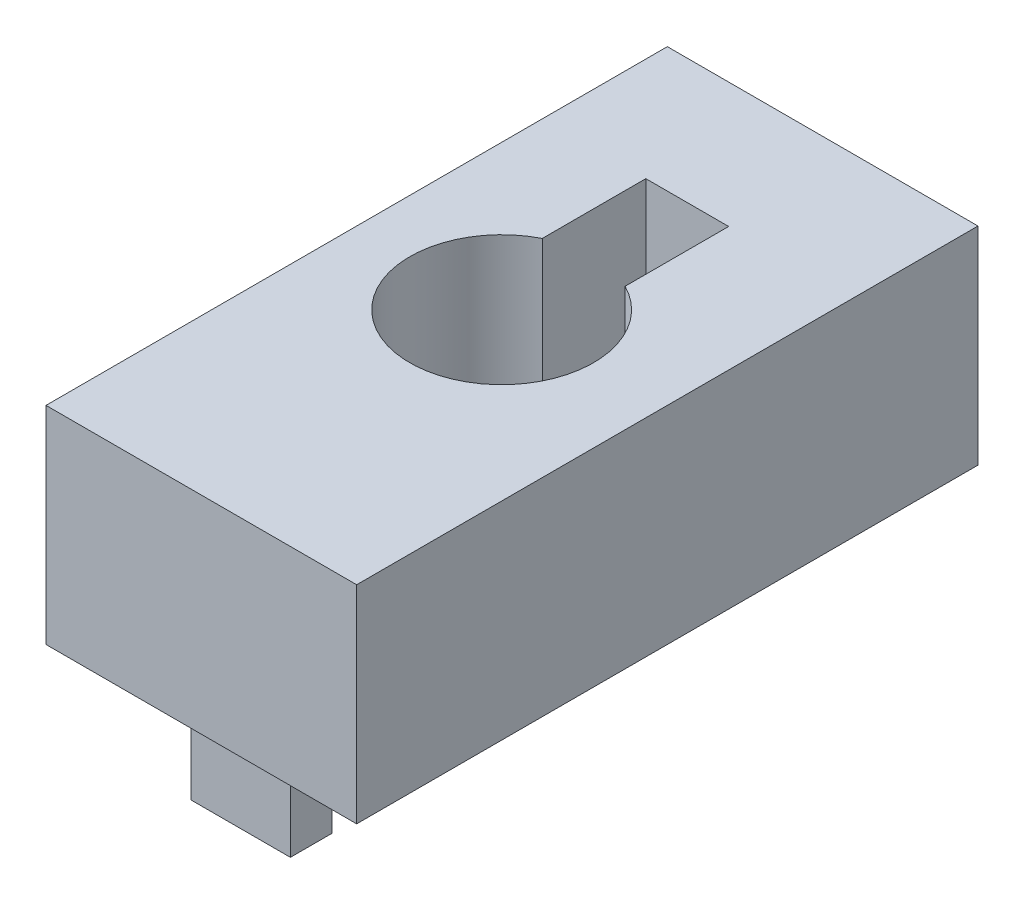
ISO-10303-21;
HEADER;
FILE_DESCRIPTION(('STEP AP214'),'2;1');
FILE_NAME('part.step','',(''),(''),'','','');
FILE_SCHEMA(('AUTOMOTIVE_DESIGN { 1 0 10303 214 1 1 1 1 }'));
ENDSEC;
DATA;
#1=APPLICATION_CONTEXT('core data for automotive mechanical design processes');
#2=APPLICATION_PROTOCOL_DEFINITION('international standard','automotive_design',2000,#1);
#3=PRODUCT_CONTEXT('',#1,'mechanical');
#4=PRODUCT('Part','Part','',(#3));
#5=PRODUCT_RELATED_PRODUCT_CATEGORY('part','',(#4));
#6=PRODUCT_DEFINITION_FORMATION('','',#4);
#7=PRODUCT_DEFINITION_CONTEXT('part definition',#1,'design');
#8=PRODUCT_DEFINITION('design','',#6,#7);
#9=PRODUCT_DEFINITION_SHAPE('','',#8);
#10=(LENGTH_UNIT() NAMED_UNIT(*) SI_UNIT(.MILLI.,.METRE.));
#11=(NAMED_UNIT(*) PLANE_ANGLE_UNIT() SI_UNIT($,.RADIAN.));
#12=(NAMED_UNIT(*) SI_UNIT($,.STERADIAN.) SOLID_ANGLE_UNIT());
#13=UNCERTAINTY_MEASURE_WITH_UNIT(LENGTH_MEASURE(1.E-05),#10,'distance_accuracy_value','');
#14=(GEOMETRIC_REPRESENTATION_CONTEXT(3) GLOBAL_UNCERTAINTY_ASSIGNED_CONTEXT((#13)) GLOBAL_UNIT_ASSIGNED_CONTEXT((#10,
#11,#12)) REPRESENTATION_CONTEXT('',''));
#15=CARTESIAN_POINT('',(0.,0.,0.));
#16=DIRECTION('',(0.,0.,1.));
#17=DIRECTION('',(1.,0.,0.));
#18=AXIS2_PLACEMENT_3D('',#15,#16,#17);
#19=CARTESIAN_POINT('',(0.,0.,0.));
#20=DIRECTION('',(0.,1.,0.));
#21=DIRECTION('',(0.,0.,1.));
#22=AXIS2_PLACEMENT_3D('',#19,#20,#21);
#23=PLANE('',#22);
#24=DIRECTION('',(1.,0.,0.));
#25=VECTOR('',#24,1.);
#26=CARTESIAN_POINT('',(13.716,0.,-1.27000000000001));
#27=LINE('',#26,#25);
#28=CARTESIAN_POINT('',(7.62,0.,-1.27));
#29=VERTEX_POINT('',#28);
#30=CARTESIAN_POINT('',(13.716,0.,-1.27000000000001));
#31=VERTEX_POINT('',#30);
#32=EDGE_CURVE('E203',#29,#31,#27,.T.);
#33=ORIENTED_EDGE('',*,*,#32,.T.);
#34=DIRECTION('',(0.,0.,-1.));
#35=VECTOR('',#34,1.);
#36=CARTESIAN_POINT('',(13.716,0.,-1.27000000000001));
#37=LINE('',#36,#35);
#38=CARTESIAN_POINT('',(13.716,0.,-3.81000000000001));
#39=VERTEX_POINT('',#38);
#40=EDGE_CURVE('E171',#31,#39,#37,.T.);
#41=ORIENTED_EDGE('',*,*,#40,.T.);
#42=DIRECTION('',(-1.,0.,0.));
#43=VECTOR('',#42,1.);
#44=CARTESIAN_POINT('',(13.716,0.,-3.81000000000001));
#45=LINE('',#44,#43);
#46=CARTESIAN_POINT('',(7.62,0.,-3.81000000000001));
#47=VERTEX_POINT('',#46);
#48=EDGE_CURVE('E189',#39,#47,#45,.T.);
#49=ORIENTED_EDGE('',*,*,#48,.T.);
#50=DIRECTION('',(0.,0.,1.));
#51=VECTOR('',#50,1.);
#52=CARTESIAN_POINT('',(7.62,0.,-1.27));
#53=LINE('',#52,#51);
#54=EDGE_CURVE('E61',#47,#29,#53,.T.);
#55=ORIENTED_EDGE('',*,*,#54,.T.);
#56=EDGE_LOOP('',(#33,#41,#49,#55));
#57=FACE_BOUND('',#56,.T.);
#58=DIRECTION('',(1.,0.,0.));
#59=VECTOR('',#58,1.);
#60=CARTESIAN_POINT('',(0.,0.,0.));
#61=LINE('',#60,#59);
#62=CARTESIAN_POINT('',(0.,0.,0.));
#63=VERTEX_POINT('',#62);
#64=CARTESIAN_POINT('',(19.05,0.,0.));
#65=VERTEX_POINT('',#64);
#66=EDGE_CURVE('E306',#63,#65,#61,.T.);
#67=ORIENTED_EDGE('',*,*,#66,.F.);
#68=DIRECTION('',(0.,0.,1.));
#69=VECTOR('',#68,1.);
#70=CARTESIAN_POINT('',(0.,0.,-38.1));
#71=LINE('',#70,#69);
#72=CARTESIAN_POINT('',(0.,0.,-38.1));
#73=VERTEX_POINT('',#72);
#74=EDGE_CURVE('E315',#73,#63,#71,.T.);
#75=ORIENTED_EDGE('',*,*,#74,.F.);
#76=DIRECTION('',(-1.,0.,0.));
#77=VECTOR('',#76,1.);
#78=CARTESIAN_POINT('',(19.05,0.,-38.1));
#79=LINE('',#78,#77);
#80=CARTESIAN_POINT('',(19.05,0.,-38.1));
#81=VERTEX_POINT('',#80);
#82=EDGE_CURVE('E332',#81,#73,#79,.T.);
#83=ORIENTED_EDGE('',*,*,#82,.F.);
#84=DIRECTION('',(0.,0.,-1.));
#85=VECTOR('',#84,1.);
#86=CARTESIAN_POINT('',(19.05,0.,-19.05));
#87=LINE('',#86,#85);
#88=EDGE_CURVE('E329',#65,#81,#87,.T.);
#89=ORIENTED_EDGE('',*,*,#88,.F.);
#90=EDGE_LOOP('',(#67,#75,#83,#89));
#91=FACE_BOUND('',#90,.T.);
#92=DIRECTION('',(-1.,0.,0.));
#93=VECTOR('',#92,1.);
#94=CARTESIAN_POINT('',(11.43,0.,-24.0800721040468));
#95=LINE('',#94,#93);
#96=CARTESIAN_POINT('',(11.43,0.,-24.0800721040468));
#97=VERTEX_POINT('',#96);
#98=CARTESIAN_POINT('',(6.35,0.,-24.0800721040468));
#99=VERTEX_POINT('',#98);
#100=EDGE_CURVE('E276',#97,#99,#95,.T.);
#101=ORIENTED_EDGE('',*,*,#100,.F.);
#102=DIRECTION('',(0.,0.,1.));
#103=VECTOR('',#102,1.);
#104=CARTESIAN_POINT('',(11.43,0.,-24.0800721040468));
#105=LINE('',#104,#103);
#106=CARTESIAN_POINT('',(11.43,0.,-30.4300721040468));
#107=VERTEX_POINT('',#106);
#108=EDGE_CURVE('E259',#107,#97,#105,.T.);
#109=ORIENTED_EDGE('',*,*,#108,.F.);
#110=DIRECTION('',(1.,0.,0.));
#111=VECTOR('',#110,1.);
#112=CARTESIAN_POINT('',(11.43,0.,-30.4300721040468));
#113=LINE('',#112,#111);
#114=CARTESIAN_POINT('',(6.35,0.,-30.4300721040468));
#115=VERTEX_POINT('',#114);
#116=EDGE_CURVE('E265',#115,#107,#113,.T.);
#117=ORIENTED_EDGE('',*,*,#116,.F.);
#118=DIRECTION('',(0.,0.,-1.));
#119=VECTOR('',#118,1.);
#120=CARTESIAN_POINT('',(6.35,0.,-24.0800721040468));
#121=LINE('',#120,#119);
#122=EDGE_CURVE('E280',#99,#115,#121,.T.);
#123=ORIENTED_EDGE('',*,*,#122,.F.);
#124=EDGE_LOOP('',(#101,#109,#117,#123));
#125=FACE_BOUND('',#124,.T.);
#126=DIRECTION('',(0.,0.,1.));
#127=VECTOR('',#126,1.);
#128=CARTESIAN_POINT('',(13.716,0.,-36.83));
#129=LINE('',#128,#127);
#130=CARTESIAN_POINT('',(13.716,0.,-36.83));
#131=VERTEX_POINT('',#130);
#132=CARTESIAN_POINT('',(13.716,0.,-34.29));
#133=VERTEX_POINT('',#132);
#134=EDGE_CURVE('E177',#131,#133,#129,.T.);
#135=ORIENTED_EDGE('',*,*,#134,.F.);
#136=DIRECTION('',(1.,0.,0.));
#137=VECTOR('',#136,1.);
#138=CARTESIAN_POINT('',(13.716,0.,-36.83));
#139=LINE('',#138,#137);
#140=CARTESIAN_POINT('',(7.62,0.,-36.83));
#141=VERTEX_POINT('',#140);
#142=EDGE_CURVE('E223',#141,#131,#139,.T.);
#143=ORIENTED_EDGE('',*,*,#142,.F.);
#144=DIRECTION('',(0.,0.,-1.));
#145=VECTOR('',#144,1.);
#146=CARTESIAN_POINT('',(7.62,0.,-36.83));
#147=LINE('',#146,#145);
#148=CARTESIAN_POINT('',(7.62,0.,-34.29));
#149=VERTEX_POINT('',#148);
#150=EDGE_CURVE('E238',#149,#141,#147,.T.);
#151=ORIENTED_EDGE('',*,*,#150,.F.);
#152=DIRECTION('',(-1.,0.,0.));
#153=VECTOR('',#152,1.);
#154=CARTESIAN_POINT('',(13.716,0.,-34.29));
#155=LINE('',#154,#153);
#156=EDGE_CURVE('E69',#133,#149,#155,.T.);
#157=ORIENTED_EDGE('',*,*,#156,.F.);
#158=EDGE_LOOP('',(#135,#143,#151,#157));
#159=FACE_BOUND('',#158,.T.);
#160=ADVANCED_FACE('F45',(#57,#91,#125,#159),#23,.F.);
#161=CARTESIAN_POINT('',(0.,12.7,0.));
#162=DIRECTION('',(0.,0.,-1.));
#163=DIRECTION('',(-1.,0.,0.));
#164=AXIS2_PLACEMENT_3D('',#161,#162,#163);
#165=PLANE('',#164);
#166=ORIENTED_EDGE('',*,*,#66,.T.);
#167=DIRECTION('',(0.,-1.,0.));
#168=VECTOR('',#167,1.);
#169=CARTESIAN_POINT('',(19.05,12.7,0.));
#170=LINE('',#169,#168);
#171=CARTESIAN_POINT('',(19.05,12.7,0.));
#172=VERTEX_POINT('',#171);
#173=EDGE_CURVE('E344',#172,#65,#170,.T.);
#174=ORIENTED_EDGE('',*,*,#173,.F.);
#175=DIRECTION('',(1.,0.,0.));
#176=VECTOR('',#175,1.);
#177=CARTESIAN_POINT('',(0.,12.7,0.));
#178=LINE('',#177,#176);
#179=CARTESIAN_POINT('',(0.,12.7,0.));
#180=VERTEX_POINT('',#179);
#181=EDGE_CURVE('E314',#180,#172,#178,.T.);
#182=ORIENTED_EDGE('',*,*,#181,.F.);
#183=DIRECTION('',(0.,-1.,0.));
#184=VECTOR('',#183,1.);
#185=CARTESIAN_POINT('',(0.,12.7,0.));
#186=LINE('',#185,#184);
#187=EDGE_CURVE('E54',#180,#63,#186,.T.);
#188=ORIENTED_EDGE('',*,*,#187,.T.);
#189=EDGE_LOOP('',(#166,#174,#182,#188));
#190=FACE_BOUND('',#189,.T.);
#191=ADVANCED_FACE('F47',(#190),#165,.F.);
#192=CARTESIAN_POINT('',(19.05,12.7,-19.05));
#193=DIRECTION('',(-1.,0.,0.));
#194=DIRECTION('',(0.,0.,1.));
#195=AXIS2_PLACEMENT_3D('',#192,#193,#194);
#196=PLANE('',#195);
#197=ORIENTED_EDGE('',*,*,#88,.T.);
#198=DIRECTION('',(0.,-1.,0.));
#199=VECTOR('',#198,1.);
#200=CARTESIAN_POINT('',(19.05,12.7,-38.1));
#201=LINE('',#200,#199);
#202=CARTESIAN_POINT('',(19.05,12.7,-38.1));
#203=VERTEX_POINT('',#202);
#204=EDGE_CURVE('E340',#203,#81,#201,.T.);
#205=ORIENTED_EDGE('',*,*,#204,.F.);
#206=DIRECTION('',(0.,0.,-1.));
#207=VECTOR('',#206,1.);
#208=CARTESIAN_POINT('',(19.05,12.7,0.));
#209=LINE('',#208,#207);
#210=EDGE_CURVE('E318',#172,#203,#209,.T.);
#211=ORIENTED_EDGE('',*,*,#210,.F.);
#212=ORIENTED_EDGE('',*,*,#173,.T.);
#213=EDGE_LOOP('',(#197,#205,#211,#212));
#214=FACE_BOUND('',#213,.T.);
#215=ADVANCED_FACE('F362',(#214),#196,.F.);
#216=CARTESIAN_POINT('',(19.05,12.7,-38.1));
#217=DIRECTION('',(0.,0.,1.));
#218=DIRECTION('',(1.,0.,0.));
#219=AXIS2_PLACEMENT_3D('',#216,#217,#218);
#220=PLANE('',#219);
#221=ORIENTED_EDGE('',*,*,#82,.T.);
#222=DIRECTION('',(0.,-1.,0.));
#223=VECTOR('',#222,1.);
#224=CARTESIAN_POINT('',(0.,12.7,-38.1));
#225=LINE('',#224,#223);
#226=CARTESIAN_POINT('',(0.,12.7,-38.1));
#227=VERTEX_POINT('',#226);
#228=EDGE_CURVE('E325',#227,#73,#225,.T.);
#229=ORIENTED_EDGE('',*,*,#228,.F.);
#230=DIRECTION('',(-1.,0.,0.));
#231=VECTOR('',#230,1.);
#232=CARTESIAN_POINT('',(19.05,12.7,-38.1));
#233=LINE('',#232,#231);
#234=EDGE_CURVE('E321',#203,#227,#233,.T.);
#235=ORIENTED_EDGE('',*,*,#234,.F.);
#236=ORIENTED_EDGE('',*,*,#204,.T.);
#237=EDGE_LOOP('',(#221,#229,#235,#236));
#238=FACE_BOUND('',#237,.T.);
#239=ADVANCED_FACE('F366',(#238),#220,.F.);
#240=CARTESIAN_POINT('',(0.,12.7,-38.1));
#241=DIRECTION('',(1.,0.,0.));
#242=DIRECTION('',(0.,0.,-1.));
#243=AXIS2_PLACEMENT_3D('',#240,#241,#242);
#244=PLANE('',#243);
#245=ORIENTED_EDGE('',*,*,#74,.T.);
#246=ORIENTED_EDGE('',*,*,#187,.F.);
#247=DIRECTION('',(0.,0.,1.));
#248=VECTOR('',#247,1.);
#249=CARTESIAN_POINT('',(0.,12.7,-19.05));
#250=LINE('',#249,#248);
#251=EDGE_CURVE('E310',#227,#180,#250,.T.);
#252=ORIENTED_EDGE('',*,*,#251,.F.);
#253=ORIENTED_EDGE('',*,*,#228,.T.);
#254=EDGE_LOOP('',(#245,#246,#252,#253));
#255=FACE_BOUND('',#254,.T.);
#256=ADVANCED_FACE('F354',(#255),#244,.F.);
#257=CARTESIAN_POINT('',(0.,12.7,0.));
#258=DIRECTION('',(0.,1.,0.));
#259=DIRECTION('',(0.,0.,1.));
#260=AXIS2_PLACEMENT_3D('',#257,#258,#259);
#261=PLANE('',#260);
#262=DIRECTION('',(0.,0.,1.));
#263=VECTOR('',#262,1.);
#264=CARTESIAN_POINT('',(11.43,12.7,-24.0800721040468));
#265=LINE('',#264,#263);
#266=CARTESIAN_POINT('',(11.43,12.7,-30.4300721040468));
#267=VERTEX_POINT('',#266);
#268=CARTESIAN_POINT('',(11.43,12.7,-24.0800721040468));
#269=VERTEX_POINT('',#268);
#270=EDGE_CURVE('E260',#267,#269,#265,.T.);
#271=ORIENTED_EDGE('',*,*,#270,.T.);
#272=CARTESIAN_POINT('',(8.89,12.7,-19.05));
#273=DIRECTION('',(0.,-1.,0.));
#274=DIRECTION('',(0.,0.,-1.));
#275=AXIS2_PLACEMENT_3D('',#272,#273,#274);
#276=CIRCLE('',#275,5.63500003300001);
#277=CARTESIAN_POINT('',(6.35,12.7,-24.0800721040468));
#278=VERTEX_POINT('',#277);
#279=EDGE_CURVE('E290',#269,#278,#276,.T.);
#280=ORIENTED_EDGE('',*,*,#279,.T.);
#281=DIRECTION('',(0.,0.,-1.));
#282=VECTOR('',#281,1.);
#283=CARTESIAN_POINT('',(6.35,12.7,-24.0800721040468));
#284=LINE('',#283,#282);
#285=CARTESIAN_POINT('',(6.35,12.7,-30.4300721040468));
#286=VERTEX_POINT('',#285);
#287=EDGE_CURVE('E264',#278,#286,#284,.T.);
#288=ORIENTED_EDGE('',*,*,#287,.T.);
#289=DIRECTION('',(1.,0.,0.));
#290=VECTOR('',#289,1.);
#291=CARTESIAN_POINT('',(11.43,12.7,-30.4300721040468));
#292=LINE('',#291,#290);
#293=EDGE_CURVE('E269',#286,#267,#292,.T.);
#294=ORIENTED_EDGE('',*,*,#293,.T.);
#295=EDGE_LOOP('',(#271,#280,#288,#294));
#296=FACE_BOUND('',#295,.T.);
#297=ORIENTED_EDGE('',*,*,#251,.T.);
#298=ORIENTED_EDGE('',*,*,#181,.T.);
#299=ORIENTED_EDGE('',*,*,#210,.T.);
#300=ORIENTED_EDGE('',*,*,#234,.T.);
#301=EDGE_LOOP('',(#297,#298,#299,#300));
#302=FACE_BOUND('',#301,.T.);
#303=ADVANCED_FACE('F368',(#296,#302),#261,.T.);
#304=CARTESIAN_POINT('',(8.89,3.142000066,-19.05));
#305=DIRECTION('',(0.,1.,0.));
#306=DIRECTION('',(0.,0.,1.));
#307=AXIS2_PLACEMENT_3D('',#304,#305,#306);
#308=CYLINDRICAL_SURFACE('',#307,5.63500003300001);
#309=DIRECTION('',(0.,-1.,0.));
#310=VECTOR('',#309,1.);
#311=CARTESIAN_POINT('',(11.43,12.7,-24.0800721040468));
#312=LINE('',#311,#310);
#313=CARTESIAN_POINT('',(11.43,3.142000066,-24.0800721040468));
#314=VERTEX_POINT('',#313);
#315=EDGE_CURVE('E298',#269,#314,#312,.T.);
#316=ORIENTED_EDGE('',*,*,#315,.T.);
#317=CARTESIAN_POINT('',(8.89,3.142000066,-19.05));
#318=DIRECTION('',(0.,-1.,0.));
#319=DIRECTION('',(0.,0.,-1.));
#320=AXIS2_PLACEMENT_3D('',#317,#318,#319);
#321=CIRCLE('',#320,5.63500003300001);
#322=CARTESIAN_POINT('',(6.35,3.142000066,-24.0800721040468));
#323=VERTEX_POINT('',#322);
#324=EDGE_CURVE('E302',#314,#323,#321,.T.);
#325=ORIENTED_EDGE('',*,*,#324,.T.);
#326=DIRECTION('',(0.,-1.,0.));
#327=VECTOR('',#326,1.);
#328=CARTESIAN_POINT('',(6.35,12.7,-24.0800721040468));
#329=LINE('',#328,#327);
#330=EDGE_CURVE('E294',#278,#323,#329,.T.);
#331=ORIENTED_EDGE('',*,*,#330,.F.);
#332=ORIENTED_EDGE('',*,*,#279,.F.);
#333=EDGE_LOOP('',(#316,#325,#331,#332));
#334=FACE_BOUND('',#333,.T.);
#335=ADVANCED_FACE('F370',(#334),#308,.F.);
#336=CARTESIAN_POINT('',(8.89,3.142000066,-19.05));
#337=DIRECTION('',(0.,-1.,0.));
#338=DIRECTION('',(0.,0.,-1.));
#339=AXIS2_PLACEMENT_3D('',#336,#337,#338);
#340=PLANE('',#339);
#341=ORIENTED_EDGE('',*,*,#324,.F.);
#342=DIRECTION('',(-1.,0.,0.));
#343=VECTOR('',#342,1.);
#344=CARTESIAN_POINT('',(8.89,3.142000066,-24.0800721040468));
#345=LINE('',#344,#343);
#346=EDGE_CURVE('E12',#314,#323,#345,.T.);
#347=ORIENTED_EDGE('',*,*,#346,.T.);
#348=EDGE_LOOP('',(#341,#347));
#349=FACE_BOUND('',#348,.T.);
#350=ADVANCED_FACE('F377',(#349),#340,.F.);
#351=CARTESIAN_POINT('',(11.43,12.7,-24.0800721040468));
#352=DIRECTION('',(0.,0.,1.));
#353=DIRECTION('',(1.,0.,0.));
#354=AXIS2_PLACEMENT_3D('',#351,#352,#353);
#355=PLANE('',#354);
#356=EDGE_CURVE('E273',#314,#97,#312,.T.);
#357=ORIENTED_EDGE('',*,*,#356,.T.);
#358=ORIENTED_EDGE('',*,*,#100,.T.);
#359=EDGE_CURVE('E297',#323,#99,#329,.T.);
#360=ORIENTED_EDGE('',*,*,#359,.F.);
#361=ORIENTED_EDGE('',*,*,#346,.F.);
#362=EDGE_LOOP('',(#357,#358,#360,#361));
#363=FACE_BOUND('',#362,.T.);
#364=ADVANCED_FACE('F424',(#363),#355,.F.);
#365=CARTESIAN_POINT('',(11.43,12.7,-24.0800721040468));
#366=DIRECTION('',(1.,0.,0.));
#367=DIRECTION('',(0.,0.,-1.));
#368=AXIS2_PLACEMENT_3D('',#365,#366,#367);
#369=PLANE('',#368);
#370=ORIENTED_EDGE('',*,*,#108,.T.);
#371=ORIENTED_EDGE('',*,*,#356,.F.);
#372=ORIENTED_EDGE('',*,*,#315,.F.);
#373=ORIENTED_EDGE('',*,*,#270,.F.);
#374=DIRECTION('',(0.,-1.,0.));
#375=VECTOR('',#374,1.);
#376=CARTESIAN_POINT('',(11.43,12.7,-30.4300721040468));
#377=LINE('',#376,#375);
#378=EDGE_CURVE('E287',#267,#107,#377,.T.);
#379=ORIENTED_EDGE('',*,*,#378,.T.);
#380=EDGE_LOOP('',(#370,#371,#372,#373,#379));
#381=FACE_BOUND('',#380,.T.);
#382=ADVANCED_FACE('F435',(#381),#369,.F.);
#383=CARTESIAN_POINT('',(11.43,12.7,-30.4300721040468));
#384=DIRECTION('',(0.,0.,-1.));
#385=DIRECTION('',(-1.,0.,0.));
#386=AXIS2_PLACEMENT_3D('',#383,#384,#385);
#387=PLANE('',#386);
#388=ORIENTED_EDGE('',*,*,#116,.T.);
#389=ORIENTED_EDGE('',*,*,#378,.F.);
#390=ORIENTED_EDGE('',*,*,#293,.F.);
#391=DIRECTION('',(0.,-1.,0.));
#392=VECTOR('',#391,1.);
#393=CARTESIAN_POINT('',(6.35,12.7,-30.4300721040468));
#394=LINE('',#393,#392);
#395=EDGE_CURVE('E291',#286,#115,#394,.T.);
#396=ORIENTED_EDGE('',*,*,#395,.T.);
#397=EDGE_LOOP('',(#388,#389,#390,#396));
#398=FACE_BOUND('',#397,.T.);
#399=ADVANCED_FACE('F446',(#398),#387,.F.);
#400=CARTESIAN_POINT('',(6.35,12.7,-24.0800721040468));
#401=DIRECTION('',(-1.,0.,0.));
#402=DIRECTION('',(0.,0.,1.));
#403=AXIS2_PLACEMENT_3D('',#400,#401,#402);
#404=PLANE('',#403);
#405=ORIENTED_EDGE('',*,*,#122,.T.);
#406=ORIENTED_EDGE('',*,*,#395,.F.);
#407=ORIENTED_EDGE('',*,*,#287,.F.);
#408=ORIENTED_EDGE('',*,*,#330,.T.);
#409=ORIENTED_EDGE('',*,*,#359,.T.);
#410=EDGE_LOOP('',(#405,#406,#407,#408,#409));
#411=FACE_BOUND('',#410,.T.);
#412=ADVANCED_FACE('F457',(#411),#404,.F.);
#413=CARTESIAN_POINT('',(13.716,-5.08,-36.83));
#414=DIRECTION('',(-1.,0.,0.));
#415=DIRECTION('',(0.,0.,1.));
#416=AXIS2_PLACEMENT_3D('',#413,#414,#415);
#417=PLANE('',#416);
#418=ORIENTED_EDGE('',*,*,#134,.T.);
#419=DIRECTION('',(0.,1.,0.));
#420=VECTOR('',#419,1.);
#421=CARTESIAN_POINT('',(13.716,-5.08,-34.29));
#422=LINE('',#421,#420);
#423=CARTESIAN_POINT('',(13.716,-5.08,-34.29));
#424=VERTEX_POINT('',#423);
#425=EDGE_CURVE('E256',#424,#133,#422,.T.);
#426=ORIENTED_EDGE('',*,*,#425,.F.);
#427=DIRECTION('',(0.,0.,1.));
#428=VECTOR('',#427,1.);
#429=CARTESIAN_POINT('',(13.716,-5.08,-36.83));
#430=LINE('',#429,#428);
#431=CARTESIAN_POINT('',(13.716,-5.08,-36.83));
#432=VERTEX_POINT('',#431);
#433=EDGE_CURVE('E218',#432,#424,#430,.T.);
#434=ORIENTED_EDGE('',*,*,#433,.F.);
#435=DIRECTION('',(0.,1.,0.));
#436=VECTOR('',#435,1.);
#437=CARTESIAN_POINT('',(13.716,-5.08,-36.83));
#438=LINE('',#437,#436);
#439=EDGE_CURVE('E232',#432,#131,#438,.T.);
#440=ORIENTED_EDGE('',*,*,#439,.T.);
#441=EDGE_LOOP('',(#418,#426,#434,#440));
#442=FACE_BOUND('',#441,.T.);
#443=ADVANCED_FACE('F468',(#442),#417,.F.);
#444=CARTESIAN_POINT('',(13.716,-5.08,-34.29));
#445=DIRECTION('',(0.,0.,-1.));
#446=DIRECTION('',(-1.,0.,0.));
#447=AXIS2_PLACEMENT_3D('',#444,#445,#446);
#448=PLANE('',#447);
#449=ORIENTED_EDGE('',*,*,#156,.T.);
#450=DIRECTION('',(0.,1.,0.));
#451=VECTOR('',#450,1.);
#452=CARTESIAN_POINT('',(7.62,-5.08,-34.29));
#453=LINE('',#452,#451);
#454=CARTESIAN_POINT('',(7.62,-5.08,-34.29));
#455=VERTEX_POINT('',#454);
#456=EDGE_CURVE('E252',#455,#149,#453,.T.);
#457=ORIENTED_EDGE('',*,*,#456,.F.);
#458=DIRECTION('',(-1.,0.,0.));
#459=VECTOR('',#458,1.);
#460=CARTESIAN_POINT('',(13.716,-5.08,-34.29));
#461=LINE('',#460,#459);
#462=EDGE_CURVE('E222',#424,#455,#461,.T.);
#463=ORIENTED_EDGE('',*,*,#462,.F.);
#464=ORIENTED_EDGE('',*,*,#425,.T.);
#465=EDGE_LOOP('',(#449,#457,#463,#464));
#466=FACE_BOUND('',#465,.T.);
#467=ADVANCED_FACE('F480',(#466),#448,.F.);
#468=CARTESIAN_POINT('',(7.62,-5.08,-36.83));
#469=DIRECTION('',(1.,0.,0.));
#470=DIRECTION('',(0.,0.,-1.));
#471=AXIS2_PLACEMENT_3D('',#468,#469,#470);
#472=PLANE('',#471);
#473=ORIENTED_EDGE('',*,*,#150,.T.);
#474=DIRECTION('',(0.,1.,0.));
#475=VECTOR('',#474,1.);
#476=CARTESIAN_POINT('',(7.62,-5.08,-36.83));
#477=LINE('',#476,#475);
#478=CARTESIAN_POINT('',(7.62,-5.08,-36.83));
#479=VERTEX_POINT('',#478);
#480=EDGE_CURVE('E248',#479,#141,#477,.T.);
#481=ORIENTED_EDGE('',*,*,#480,.F.);
#482=DIRECTION('',(0.,0.,-1.));
#483=VECTOR('',#482,1.);
#484=CARTESIAN_POINT('',(7.62,-5.08,-36.83));
#485=LINE('',#484,#483);
#486=EDGE_CURVE('E226',#455,#479,#485,.T.);
#487=ORIENTED_EDGE('',*,*,#486,.F.);
#488=ORIENTED_EDGE('',*,*,#456,.T.);
#489=EDGE_LOOP('',(#473,#481,#487,#488));
#490=FACE_BOUND('',#489,.T.);
#491=ADVANCED_FACE('F491',(#490),#472,.F.);
#492=CARTESIAN_POINT('',(13.716,-5.08,-36.83));
#493=DIRECTION('',(0.,0.,1.));
#494=DIRECTION('',(1.,0.,0.));
#495=AXIS2_PLACEMENT_3D('',#492,#493,#494);
#496=PLANE('',#495);
#497=ORIENTED_EDGE('',*,*,#142,.T.);
#498=ORIENTED_EDGE('',*,*,#439,.F.);
#499=DIRECTION('',(1.,0.,0.));
#500=VECTOR('',#499,1.);
#501=CARTESIAN_POINT('',(13.716,-5.08,-36.83));
#502=LINE('',#501,#500);
#503=EDGE_CURVE('E229',#479,#432,#502,.T.);
#504=ORIENTED_EDGE('',*,*,#503,.F.);
#505=ORIENTED_EDGE('',*,*,#480,.T.);
#506=EDGE_LOOP('',(#497,#498,#504,#505));
#507=FACE_BOUND('',#506,.T.);
#508=ADVANCED_FACE('F502',(#507),#496,.F.);
#509=CARTESIAN_POINT('',(0.,-5.08,0.));
#510=DIRECTION('',(0.,-1.,0.));
#511=DIRECTION('',(0.,0.,-1.));
#512=AXIS2_PLACEMENT_3D('',#509,#510,#511);
#513=PLANE('',#512);
#514=ORIENTED_EDGE('',*,*,#433,.T.);
#515=ORIENTED_EDGE('',*,*,#462,.T.);
#516=ORIENTED_EDGE('',*,*,#486,.T.);
#517=ORIENTED_EDGE('',*,*,#503,.T.);
#518=EDGE_LOOP('',(#514,#515,#516,#517));
#519=FACE_BOUND('',#518,.T.);
#520=ADVANCED_FACE('F513',(#519),#513,.T.);
#521=CARTESIAN_POINT('',(13.716,-5.08,-1.27000000000001));
#522=DIRECTION('',(1.,0.,0.));
#523=DIRECTION('',(0.,0.,-1.));
#524=AXIS2_PLACEMENT_3D('',#521,#522,#523);
#525=PLANE('',#524);
#526=ORIENTED_EDGE('',*,*,#40,.F.);
#527=DIRECTION('',(0.,1.,0.));
#528=VECTOR('',#527,1.);
#529=CARTESIAN_POINT('',(13.716,-5.08,-1.27000000000001));
#530=LINE('',#529,#528);
#531=CARTESIAN_POINT('',(13.716,-5.08,-1.27000000000001));
#532=VERTEX_POINT('',#531);
#533=EDGE_CURVE('E165',#532,#31,#530,.T.);
#534=ORIENTED_EDGE('',*,*,#533,.F.);
#535=DIRECTION('',(0.,0.,-1.));
#536=VECTOR('',#535,1.);
#537=CARTESIAN_POINT('',(13.716,-5.08,-1.27000000000001));
#538=LINE('',#537,#536);
#539=CARTESIAN_POINT('',(13.716,-5.08,-3.81000000000001));
#540=VERTEX_POINT('',#539);
#541=EDGE_CURVE('E168',#532,#540,#538,.T.);
#542=ORIENTED_EDGE('',*,*,#541,.T.);
#543=DIRECTION('',(0.,1.,0.));
#544=VECTOR('',#543,1.);
#545=CARTESIAN_POINT('',(13.716,-5.08,-3.81000000000001));
#546=LINE('',#545,#544);
#547=EDGE_CURVE('E200',#540,#39,#546,.T.);
#548=ORIENTED_EDGE('',*,*,#547,.T.);
#549=EDGE_LOOP('',(#526,#534,#542,#548));
#550=FACE_BOUND('',#549,.T.);
#551=ADVANCED_FACE('F167',(#550),#525,.T.);
#552=CARTESIAN_POINT('',(13.716,-5.08,-1.27000000000001));
#553=DIRECTION('',(0.,0.,1.));
#554=DIRECTION('',(1.,0.,0.));
#555=AXIS2_PLACEMENT_3D('',#552,#553,#554);
#556=PLANE('',#555);
#557=ORIENTED_EDGE('',*,*,#32,.F.);
#558=DIRECTION('',(0.,1.,0.));
#559=VECTOR('',#558,1.);
#560=CARTESIAN_POINT('',(7.62,-5.08,-1.27));
#561=LINE('',#560,#559);
#562=CARTESIAN_POINT('',(7.62,-5.08,-1.27));
#563=VERTEX_POINT('',#562);
#564=EDGE_CURVE('E178',#563,#29,#561,.T.);
#565=ORIENTED_EDGE('',*,*,#564,.F.);
#566=DIRECTION('',(1.,0.,0.));
#567=VECTOR('',#566,1.);
#568=CARTESIAN_POINT('',(13.716,-5.08,-1.27000000000001));
#569=LINE('',#568,#567);
#570=EDGE_CURVE('E184',#563,#532,#569,.T.);
#571=ORIENTED_EDGE('',*,*,#570,.T.);
#572=ORIENTED_EDGE('',*,*,#533,.T.);
#573=EDGE_LOOP('',(#557,#565,#571,#572));
#574=FACE_BOUND('',#573,.T.);
#575=ADVANCED_FACE('F191',(#574),#556,.T.);
#576=CARTESIAN_POINT('',(7.62,-5.08,-1.27));
#577=DIRECTION('',(-1.,0.,0.));
#578=DIRECTION('',(0.,0.,1.));
#579=AXIS2_PLACEMENT_3D('',#576,#577,#578);
#580=PLANE('',#579);
#581=ORIENTED_EDGE('',*,*,#54,.F.);
#582=DIRECTION('',(0.,1.,0.));
#583=VECTOR('',#582,1.);
#584=CARTESIAN_POINT('',(7.62,-5.08,-3.81));
#585=LINE('',#584,#583);
#586=CARTESIAN_POINT('',(7.62,-5.08,-3.81));
#587=VERTEX_POINT('',#586);
#588=EDGE_CURVE('E213',#587,#47,#585,.T.);
#589=ORIENTED_EDGE('',*,*,#588,.F.);
#590=DIRECTION('',(0.,0.,1.));
#591=VECTOR('',#590,1.);
#592=CARTESIAN_POINT('',(7.62,-5.08,-1.27));
#593=LINE('',#592,#591);
#594=EDGE_CURVE('E193',#587,#563,#593,.T.);
#595=ORIENTED_EDGE('',*,*,#594,.T.);
#596=ORIENTED_EDGE('',*,*,#564,.T.);
#597=EDGE_LOOP('',(#581,#589,#595,#596));
#598=FACE_BOUND('',#597,.T.);
#599=ADVANCED_FACE('F546',(#598),#580,.T.);
#600=CARTESIAN_POINT('',(13.716,-5.08,-3.81000000000001));
#601=DIRECTION('',(0.,0.,-1.));
#602=DIRECTION('',(-1.,0.,0.));
#603=AXIS2_PLACEMENT_3D('',#600,#601,#602);
#604=PLANE('',#603);
#605=ORIENTED_EDGE('',*,*,#48,.F.);
#606=ORIENTED_EDGE('',*,*,#547,.F.);
#607=DIRECTION('',(-1.,0.,0.));
#608=VECTOR('',#607,1.);
#609=CARTESIAN_POINT('',(13.716,-5.08,-3.81000000000001));
#610=LINE('',#609,#608);
#611=EDGE_CURVE('E187',#540,#587,#610,.T.);
#612=ORIENTED_EDGE('',*,*,#611,.T.);
#613=ORIENTED_EDGE('',*,*,#588,.T.);
#614=EDGE_LOOP('',(#605,#606,#612,#613));
#615=FACE_BOUND('',#614,.T.);
#616=ADVANCED_FACE('F556',(#615),#604,.T.);
#617=CARTESIAN_POINT('',(0.,-5.08,-38.1));
#618=DIRECTION('',(0.,-1.,0.));
#619=DIRECTION('',(0.,0.,1.));
#620=AXIS2_PLACEMENT_3D('',#617,#618,#619);
#621=PLANE('',#620);
#622=ORIENTED_EDGE('',*,*,#541,.F.);
#623=ORIENTED_EDGE('',*,*,#570,.F.);
#624=ORIENTED_EDGE('',*,*,#594,.F.);
#625=ORIENTED_EDGE('',*,*,#611,.F.);
#626=EDGE_LOOP('',(#622,#623,#624,#625));
#627=FACE_BOUND('',#626,.T.);
#628=ADVANCED_FACE('F182',(#627),#621,.T.);
#629=CLOSED_SHELL('',(#160,#191,#215,#239,#256,#303,#335,#350,#364,#382,#399,#412,#443,#467,
#491,#508,#520,#551,#575,#599,#616,#628));
#630=MANIFOLD_SOLID_BREP('B2',#629);
#631=ADVANCED_BREP_SHAPE_REPRESENTATION('',(#18,#630),#14);
#632=SHAPE_DEFINITION_REPRESENTATION(#9,#631);
ENDSEC;
END-ISO-10303-21;
